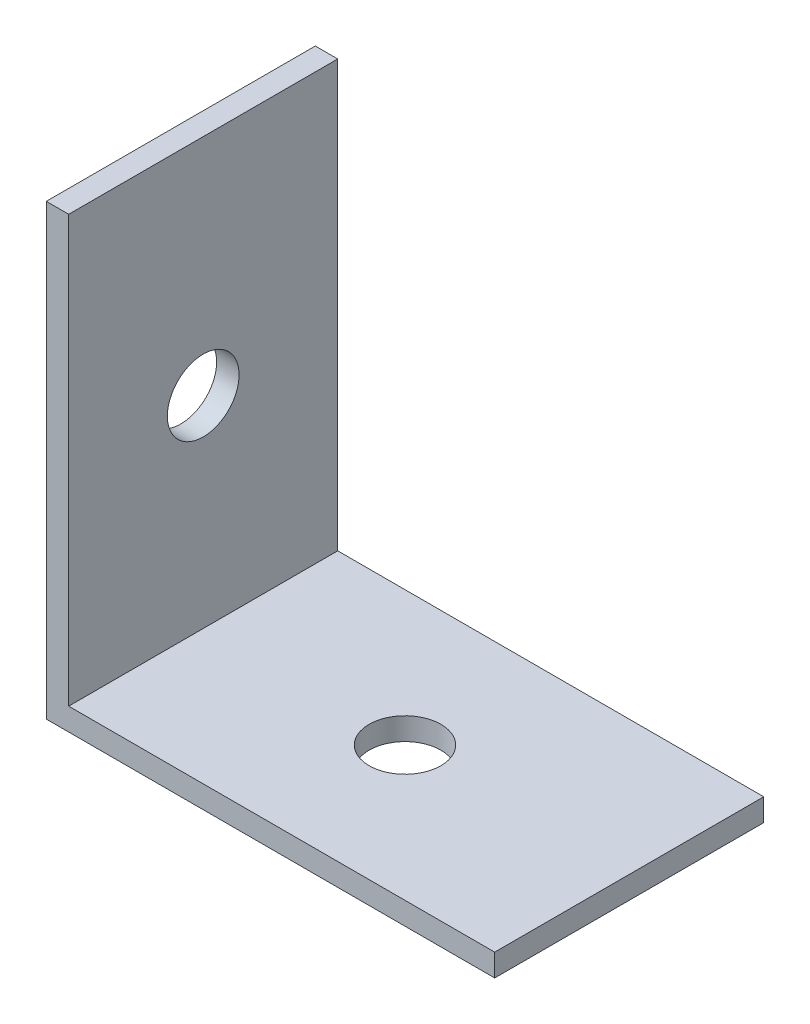
ISO-10303-21;
HEADER;
FILE_DESCRIPTION(('STEP AP214'),'2;1');
FILE_NAME('part.step','',(''),(''),'','','');
FILE_SCHEMA(('AUTOMOTIVE_DESIGN { 1 0 10303 214 1 1 1 1 }'));
ENDSEC;
DATA;
#1=APPLICATION_CONTEXT('core data for automotive mechanical design processes');
#2=APPLICATION_PROTOCOL_DEFINITION('international standard','automotive_design',2000,#1);
#3=PRODUCT_CONTEXT('',#1,'mechanical');
#4=PRODUCT('Part','Part','',(#3));
#5=PRODUCT_RELATED_PRODUCT_CATEGORY('part','',(#4));
#6=PRODUCT_DEFINITION_FORMATION('','',#4);
#7=PRODUCT_DEFINITION_CONTEXT('part definition',#1,'design');
#8=PRODUCT_DEFINITION('design','',#6,#7);
#9=PRODUCT_DEFINITION_SHAPE('','',#8);
#10=(LENGTH_UNIT() NAMED_UNIT(*) SI_UNIT(.MILLI.,.METRE.));
#11=(NAMED_UNIT(*) PLANE_ANGLE_UNIT() SI_UNIT($,.RADIAN.));
#12=(NAMED_UNIT(*) SI_UNIT($,.STERADIAN.) SOLID_ANGLE_UNIT());
#13=UNCERTAINTY_MEASURE_WITH_UNIT(LENGTH_MEASURE(1.E-05),#10,'distance_accuracy_value','');
#14=(GEOMETRIC_REPRESENTATION_CONTEXT(3) GLOBAL_UNCERTAINTY_ASSIGNED_CONTEXT((#13)) GLOBAL_UNIT_ASSIGNED_CONTEXT((#10,
#11,#12)) REPRESENTATION_CONTEXT('',''));
#15=CARTESIAN_POINT('',(0.,0.,0.));
#16=DIRECTION('',(0.,0.,1.));
#17=DIRECTION('',(1.,0.,0.));
#18=AXIS2_PLACEMENT_3D('',#15,#16,#17);
#19=CARTESIAN_POINT('',(0.,20.,12.));
#20=DIRECTION('',(1.,0.,0.));
#21=DIRECTION('',(0.,0.,-1.));
#22=AXIS2_PLACEMENT_3D('',#19,#20,#21);
#23=PLANE('',#22);
#24=CARTESIAN_POINT('',(0.,10.,6.));
#25=DIRECTION('',(-1.,0.,0.));
#26=DIRECTION('',(0.,0.,1.));
#27=AXIS2_PLACEMENT_3D('',#24,#25,#26);
#28=CIRCLE('',#27,1.6);
#29=CARTESIAN_POINT('',(0.,10.,7.6));
#30=VERTEX_POINT('',#29);
#31=EDGE_CURVE('E145',#30,#30,#28,.T.);
#32=ORIENTED_EDGE('',*,*,#31,.F.);
#33=EDGE_LOOP('',(#32));
#34=FACE_BOUND('',#33,.T.);
#35=DIRECTION('',(0.,-1.,0.));
#36=VECTOR('',#35,1.);
#37=CARTESIAN_POINT('',(0.,20.,0.));
#38=LINE('',#37,#36);
#39=CARTESIAN_POINT('',(0.,20.,0.));
#40=VERTEX_POINT('',#39);
#41=CARTESIAN_POINT('',(0.,0.,0.));
#42=VERTEX_POINT('',#41);
#43=EDGE_CURVE('E120',#40,#42,#38,.T.);
#44=ORIENTED_EDGE('',*,*,#43,.T.);
#45=DIRECTION('',(0.,0.,-1.));
#46=VECTOR('',#45,1.);
#47=CARTESIAN_POINT('',(0.,0.,12.));
#48=LINE('',#47,#46);
#49=CARTESIAN_POINT('',(0.,0.,12.));
#50=VERTEX_POINT('',#49);
#51=EDGE_CURVE('E11',#50,#42,#48,.T.);
#52=ORIENTED_EDGE('',*,*,#51,.F.);
#53=DIRECTION('',(0.,-1.,0.));
#54=VECTOR('',#53,1.);
#55=CARTESIAN_POINT('',(0.,20.,12.));
#56=LINE('',#55,#54);
#57=CARTESIAN_POINT('',(0.,20.,12.));
#58=VERTEX_POINT('',#57);
#59=EDGE_CURVE('E131',#58,#50,#56,.T.);
#60=ORIENTED_EDGE('',*,*,#59,.F.);
#61=DIRECTION('',(0.,0.,-1.));
#62=VECTOR('',#61,1.);
#63=CARTESIAN_POINT('',(0.,20.,12.));
#64=LINE('',#63,#62);
#65=EDGE_CURVE('E116',#58,#40,#64,.T.);
#66=ORIENTED_EDGE('',*,*,#65,.T.);
#67=EDGE_LOOP('',(#44,#52,#60,#66));
#68=FACE_BOUND('',#67,.T.);
#69=ADVANCED_FACE('F34',(#34,#68),#23,.F.);
#70=CARTESIAN_POINT('',(0.,0.,12.));
#71=DIRECTION('',(0.,1.,0.));
#72=DIRECTION('',(0.,0.,1.));
#73=AXIS2_PLACEMENT_3D('',#70,#71,#72);
#74=PLANE('',#73);
#75=CARTESIAN_POINT('',(10.,0.,6.));
#76=DIRECTION('',(0.,-1.,0.));
#77=DIRECTION('',(0.,0.,-1.));
#78=AXIS2_PLACEMENT_3D('',#75,#76,#77);
#79=CIRCLE('',#78,1.6);
#80=CARTESIAN_POINT('',(10.,0.,4.4));
#81=VERTEX_POINT('',#80);
#82=EDGE_CURVE('E137',#81,#81,#79,.T.);
#83=ORIENTED_EDGE('',*,*,#82,.F.);
#84=EDGE_LOOP('',(#83));
#85=FACE_BOUND('',#84,.T.);
#86=DIRECTION('',(1.,0.,0.));
#87=VECTOR('',#86,1.);
#88=CARTESIAN_POINT('',(0.,0.,0.));
#89=LINE('',#88,#87);
#90=CARTESIAN_POINT('',(20.,0.,0.));
#91=VERTEX_POINT('',#90);
#92=EDGE_CURVE('E123',#42,#91,#89,.T.);
#93=ORIENTED_EDGE('',*,*,#92,.T.);
#94=DIRECTION('',(0.,0.,-1.));
#95=VECTOR('',#94,1.);
#96=CARTESIAN_POINT('',(20.,0.,12.));
#97=LINE('',#96,#95);
#98=CARTESIAN_POINT('',(20.,0.,12.));
#99=VERTEX_POINT('',#98);
#100=EDGE_CURVE('E43',#99,#91,#97,.T.);
#101=ORIENTED_EDGE('',*,*,#100,.F.);
#102=DIRECTION('',(1.,0.,0.));
#103=VECTOR('',#102,1.);
#104=CARTESIAN_POINT('',(0.,0.,12.));
#105=LINE('',#104,#103);
#106=EDGE_CURVE('E89',#50,#99,#105,.T.);
#107=ORIENTED_EDGE('',*,*,#106,.F.);
#108=ORIENTED_EDGE('',*,*,#51,.T.);
#109=EDGE_LOOP('',(#93,#101,#107,#108));
#110=FACE_BOUND('',#109,.T.);
#111=ADVANCED_FACE('F151',(#85,#110),#74,.F.);
#112=CARTESIAN_POINT('',(20.,0.,12.));
#113=DIRECTION('',(-1.,0.,0.));
#114=DIRECTION('',(0.,0.,1.));
#115=AXIS2_PLACEMENT_3D('',#112,#113,#114);
#116=PLANE('',#115);
#117=DIRECTION('',(0.,1.,0.));
#118=VECTOR('',#117,1.);
#119=CARTESIAN_POINT('',(20.,0.,0.));
#120=LINE('',#119,#118);
#121=CARTESIAN_POINT('',(20.,1.,0.));
#122=VERTEX_POINT('',#121);
#123=EDGE_CURVE('E126',#91,#122,#120,.T.);
#124=ORIENTED_EDGE('',*,*,#123,.T.);
#125=DIRECTION('',(0.,0.,-1.));
#126=VECTOR('',#125,1.);
#127=CARTESIAN_POINT('',(20.,1.,12.));
#128=LINE('',#127,#126);
#129=CARTESIAN_POINT('',(20.,1.,12.));
#130=VERTEX_POINT('',#129);
#131=EDGE_CURVE('E111',#130,#122,#128,.T.);
#132=ORIENTED_EDGE('',*,*,#131,.F.);
#133=DIRECTION('',(0.,1.,0.));
#134=VECTOR('',#133,1.);
#135=CARTESIAN_POINT('',(20.,0.,12.));
#136=LINE('',#135,#134);
#137=EDGE_CURVE('E102',#99,#130,#136,.T.);
#138=ORIENTED_EDGE('',*,*,#137,.F.);
#139=ORIENTED_EDGE('',*,*,#100,.T.);
#140=EDGE_LOOP('',(#124,#132,#138,#139));
#141=FACE_BOUND('',#140,.T.);
#142=ADVANCED_FACE('F154',(#141),#116,.F.);
#143=CARTESIAN_POINT('',(20.,1.,12.));
#144=DIRECTION('',(0.,-1.,0.));
#145=DIRECTION('',(1.,0.,0.));
#146=AXIS2_PLACEMENT_3D('',#143,#144,#145);
#147=PLANE('',#146);
#148=CARTESIAN_POINT('',(10.,1.,6.));
#149=DIRECTION('',(0.,-1.,0.));
#150=DIRECTION('',(1.,0.,0.));
#151=AXIS2_PLACEMENT_3D('',#148,#149,#150);
#152=CIRCLE('',#151,1.6);
#153=CARTESIAN_POINT('',(11.6,1.,6.));
#154=VERTEX_POINT('',#153);
#155=EDGE_CURVE('E124',#154,#154,#152,.T.);
#156=ORIENTED_EDGE('',*,*,#155,.T.);
#157=EDGE_LOOP('',(#156));
#158=FACE_BOUND('',#157,.T.);
#159=DIRECTION('',(-1.,0.,0.));
#160=VECTOR('',#159,1.);
#161=CARTESIAN_POINT('',(20.,1.,0.));
#162=LINE('',#161,#160);
#163=CARTESIAN_POINT('',(1.,0.999999999999998,0.));
#164=VERTEX_POINT('',#163);
#165=EDGE_CURVE('E110',#122,#164,#162,.T.);
#166=ORIENTED_EDGE('',*,*,#165,.T.);
#167=DIRECTION('',(0.,0.,-1.));
#168=VECTOR('',#167,1.);
#169=CARTESIAN_POINT('',(1.,0.999999999999998,12.));
#170=LINE('',#169,#168);
#171=CARTESIAN_POINT('',(1.,0.999999999999998,12.));
#172=VERTEX_POINT('',#171);
#173=EDGE_CURVE('E107',#172,#164,#170,.T.);
#174=ORIENTED_EDGE('',*,*,#173,.F.);
#175=DIRECTION('',(-1.,0.,0.));
#176=VECTOR('',#175,1.);
#177=CARTESIAN_POINT('',(20.,1.,12.));
#178=LINE('',#177,#176);
#179=EDGE_CURVE('E96',#130,#172,#178,.T.);
#180=ORIENTED_EDGE('',*,*,#179,.F.);
#181=ORIENTED_EDGE('',*,*,#131,.T.);
#182=EDGE_LOOP('',(#166,#174,#180,#181));
#183=FACE_BOUND('',#182,.T.);
#184=ADVANCED_FACE('F108',(#158,#183),#147,.F.);
#185=CARTESIAN_POINT('',(1.,0.999999999999998,12.));
#186=DIRECTION('',(-1.,0.,0.));
#187=DIRECTION('',(0.,-1.,0.));
#188=AXIS2_PLACEMENT_3D('',#185,#186,#187);
#189=PLANE('',#188);
#190=CARTESIAN_POINT('',(1.,10.,6.));
#191=DIRECTION('',(-1.,0.,0.));
#192=DIRECTION('',(0.,-1.,0.));
#193=AXIS2_PLACEMENT_3D('',#190,#191,#192);
#194=CIRCLE('',#193,1.6);
#195=CARTESIAN_POINT('',(1.,8.4,6.));
#196=VERTEX_POINT('',#195);
#197=EDGE_CURVE('E37',#196,#196,#194,.T.);
#198=ORIENTED_EDGE('',*,*,#197,.T.);
#199=EDGE_LOOP('',(#198));
#200=FACE_BOUND('',#199,.T.);
#201=DIRECTION('',(0.,1.,0.));
#202=VECTOR('',#201,1.);
#203=CARTESIAN_POINT('',(1.,0.999999999999998,0.));
#204=LINE('',#203,#202);
#205=CARTESIAN_POINT('',(1.,20.,0.));
#206=VERTEX_POINT('',#205);
#207=EDGE_CURVE('E75',#164,#206,#204,.T.);
#208=ORIENTED_EDGE('',*,*,#207,.T.);
#209=DIRECTION('',(0.,0.,-1.));
#210=VECTOR('',#209,1.);
#211=CARTESIAN_POINT('',(1.,20.,12.));
#212=LINE('',#211,#210);
#213=CARTESIAN_POINT('',(1.,20.,12.));
#214=VERTEX_POINT('',#213);
#215=EDGE_CURVE('E112',#214,#206,#212,.T.);
#216=ORIENTED_EDGE('',*,*,#215,.F.);
#217=DIRECTION('',(0.,1.,0.));
#218=VECTOR('',#217,1.);
#219=CARTESIAN_POINT('',(1.,0.999999999999998,12.));
#220=LINE('',#219,#218);
#221=EDGE_CURVE('E100',#172,#214,#220,.T.);
#222=ORIENTED_EDGE('',*,*,#221,.F.);
#223=ORIENTED_EDGE('',*,*,#173,.T.);
#224=EDGE_LOOP('',(#208,#216,#222,#223));
#225=FACE_BOUND('',#224,.T.);
#226=ADVANCED_FACE('F114',(#200,#225),#189,.F.);
#227=CARTESIAN_POINT('',(1.,20.,12.));
#228=DIRECTION('',(0.,-1.,0.));
#229=DIRECTION('',(0.,0.,-1.));
#230=AXIS2_PLACEMENT_3D('',#227,#228,#229);
#231=PLANE('',#230);
#232=DIRECTION('',(-1.,0.,0.));
#233=VECTOR('',#232,1.);
#234=CARTESIAN_POINT('',(1.,20.,0.));
#235=LINE('',#234,#233);
#236=EDGE_CURVE('E81',#206,#40,#235,.T.);
#237=ORIENTED_EDGE('',*,*,#236,.T.);
#238=ORIENTED_EDGE('',*,*,#65,.F.);
#239=DIRECTION('',(-1.,0.,0.));
#240=VECTOR('',#239,1.);
#241=CARTESIAN_POINT('',(1.,20.,12.));
#242=LINE('',#241,#240);
#243=EDGE_CURVE('E52',#214,#58,#242,.T.);
#244=ORIENTED_EDGE('',*,*,#243,.F.);
#245=ORIENTED_EDGE('',*,*,#215,.T.);
#246=EDGE_LOOP('',(#237,#238,#244,#245));
#247=FACE_BOUND('',#246,.T.);
#248=ADVANCED_FACE('F159',(#247),#231,.F.);
#249=CARTESIAN_POINT('',(0.,0.,12.));
#250=DIRECTION('',(0.,0.,1.));
#251=DIRECTION('',(1.,0.,0.));
#252=AXIS2_PLACEMENT_3D('',#249,#250,#251);
#253=PLANE('',#252);
#254=ORIENTED_EDGE('',*,*,#59,.T.);
#255=ORIENTED_EDGE('',*,*,#106,.T.);
#256=ORIENTED_EDGE('',*,*,#137,.T.);
#257=ORIENTED_EDGE('',*,*,#179,.T.);
#258=ORIENTED_EDGE('',*,*,#221,.T.);
#259=ORIENTED_EDGE('',*,*,#243,.T.);
#260=EDGE_LOOP('',(#254,#255,#256,#257,#258,#259));
#261=FACE_BOUND('',#260,.T.);
#262=ADVANCED_FACE('F98',(#261),#253,.T.);
#263=CARTESIAN_POINT('',(0.,0.,0.));
#264=DIRECTION('',(0.,0.,1.));
#265=DIRECTION('',(1.,0.,0.));
#266=AXIS2_PLACEMENT_3D('',#263,#264,#265);
#267=PLANE('',#266);
#268=ORIENTED_EDGE('',*,*,#43,.F.);
#269=ORIENTED_EDGE('',*,*,#236,.F.);
#270=ORIENTED_EDGE('',*,*,#207,.F.);
#271=ORIENTED_EDGE('',*,*,#165,.F.);
#272=ORIENTED_EDGE('',*,*,#123,.F.);
#273=ORIENTED_EDGE('',*,*,#92,.F.);
#274=EDGE_LOOP('',(#268,#269,#270,#271,#272,#273));
#275=FACE_BOUND('',#274,.T.);
#276=ADVANCED_FACE('F157',(#275),#267,.F.);
#277=CARTESIAN_POINT('',(10.,20.,6.));
#278=DIRECTION('',(0.,-1.,0.));
#279=DIRECTION('',(0.,0.,-1.));
#280=AXIS2_PLACEMENT_3D('',#277,#278,#279);
#281=CYLINDRICAL_SURFACE('',#280,1.6);
#282=ORIENTED_EDGE('',*,*,#82,.T.);
#283=EDGE_LOOP('',(#282));
#284=FACE_BOUND('',#283,.T.);
#285=ORIENTED_EDGE('',*,*,#155,.F.);
#286=EDGE_LOOP('',(#285));
#287=FACE_BOUND('',#286,.T.);
#288=ADVANCED_FACE('F184',(#284,#287),#281,.F.);
#289=CARTESIAN_POINT('',(20.,10.,6.));
#290=DIRECTION('',(-1.,0.,0.));
#291=DIRECTION('',(0.,0.,1.));
#292=AXIS2_PLACEMENT_3D('',#289,#290,#291);
#293=CYLINDRICAL_SURFACE('',#292,1.6);
#294=ORIENTED_EDGE('',*,*,#31,.T.);
#295=EDGE_LOOP('',(#294));
#296=FACE_BOUND('',#295,.T.);
#297=ORIENTED_EDGE('',*,*,#197,.F.);
#298=EDGE_LOOP('',(#297));
#299=FACE_BOUND('',#298,.T.);
#300=ADVANCED_FACE('F181',(#296,#299),#293,.F.);
#301=CLOSED_SHELL('',(#69,#111,#142,#184,#226,#248,#262,#276,#288,#300));
#302=MANIFOLD_SOLID_BREP('B2',#301);
#303=ADVANCED_BREP_SHAPE_REPRESENTATION('',(#18,#302),#14);
#304=SHAPE_DEFINITION_REPRESENTATION(#9,#303);
ENDSEC;
END-ISO-10303-21;
